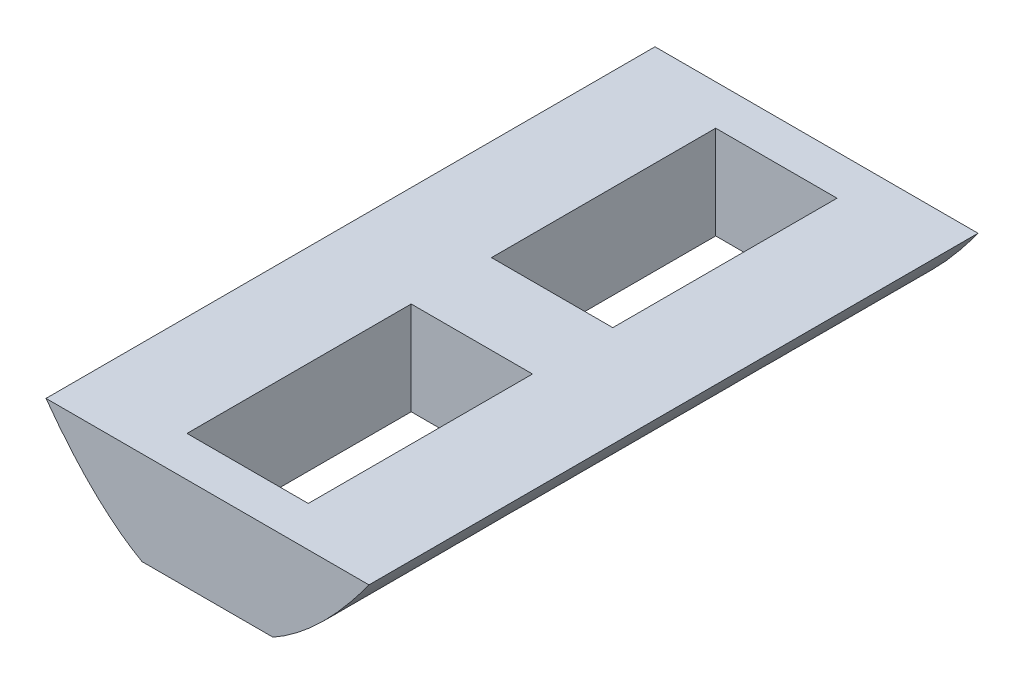
ISO-10303-21;
HEADER;
FILE_DESCRIPTION(('STEP AP214'),'2;1');
FILE_NAME('part.step','',(''),(''),'','','');
FILE_SCHEMA(('AUTOMOTIVE_DESIGN { 1 0 10303 214 1 1 1 1 }'));
ENDSEC;
DATA;
#1=APPLICATION_CONTEXT('core data for automotive mechanical design processes');
#2=APPLICATION_PROTOCOL_DEFINITION('international standard','automotive_design',2000,#1);
#3=PRODUCT_CONTEXT('',#1,'mechanical');
#4=PRODUCT('Part','Part','',(#3));
#5=PRODUCT_RELATED_PRODUCT_CATEGORY('part','',(#4));
#6=PRODUCT_DEFINITION_FORMATION('','',#4);
#7=PRODUCT_DEFINITION_CONTEXT('part definition',#1,'design');
#8=PRODUCT_DEFINITION('design','',#6,#7);
#9=PRODUCT_DEFINITION_SHAPE('','',#8);
#10=(LENGTH_UNIT() NAMED_UNIT(*) SI_UNIT(.MILLI.,.METRE.));
#11=(NAMED_UNIT(*) PLANE_ANGLE_UNIT() SI_UNIT($,.RADIAN.));
#12=(NAMED_UNIT(*) SI_UNIT($,.STERADIAN.) SOLID_ANGLE_UNIT());
#13=UNCERTAINTY_MEASURE_WITH_UNIT(LENGTH_MEASURE(1.E-05),#10,'distance_accuracy_value','');
#14=(GEOMETRIC_REPRESENTATION_CONTEXT(3) GLOBAL_UNCERTAINTY_ASSIGNED_CONTEXT((#13)) GLOBAL_UNIT_ASSIGNED_CONTEXT((#10,
#11,#12)) REPRESENTATION_CONTEXT('',''));
#15=CARTESIAN_POINT('',(0.,0.,0.));
#16=DIRECTION('',(0.,0.,1.));
#17=DIRECTION('',(1.,0.,0.));
#18=AXIS2_PLACEMENT_3D('',#15,#16,#17);
#19=CARTESIAN_POINT('',(-127.000000000214,127.000000000428,331.382));
#20=CARTESIAN_POINT('',(-3.79340656109228E-11,-127.000000000353,331.382));
#21=CARTESIAN_POINT('',(127.000000000138,127.000000000277,331.382));
#22=B_SPLINE_CURVE_WITH_KNOTS('',2,(#19,#20,#21),.UNSPECIFIED.,.F.,.F.,(3,3),
(0.0560283962320779,0.943971603767657),.UNSPECIFIED.);
#23=DIRECTION('',(0.,0.,-1.));
#24=VECTOR('',#23,1.);
#25=SURFACE_OF_LINEAR_EXTRUSION('',#22,#24);
#26=CARTESIAN_POINT('',(-87.8726351031225,60.8,331.382));
#27=VERTEX_POINT('',#26);
#28=CARTESIAN_POINT('',(-35.6370593624671,10.,331.382));
#29=VERTEX_POINT('',#28);
#30=EDGE_CURVE('E135',#27,#29,#22,.T.);
#31=ORIENTED_EDGE('',*,*,#30,.F.);
#32=DIRECTION('',(0.,0.,-1.));
#33=VECTOR('',#32,1.);
#34=CARTESIAN_POINT('',(-87.872635103313,60.8,331.382));
#35=LINE('',#34,#33);
#36=CARTESIAN_POINT('',(-87.8726351031226,60.8,0.));
#37=VERTEX_POINT('',#36);
#38=EDGE_CURVE('E121',#27,#37,#35,.T.);
#39=ORIENTED_EDGE('',*,*,#38,.T.);
#40=CARTESIAN_POINT('',(-127.000000000214,127.000000000428,0.));
#41=CARTESIAN_POINT('',(-3.79340656109228E-11,-127.000000000353,0.));
#42=CARTESIAN_POINT('',(127.000000000138,127.000000000277,0.));
#43=B_SPLINE_CURVE_WITH_KNOTS('',2,(#40,#41,#42),.UNSPECIFIED.,.F.,.F.,(3,3),
(0.0560283962320779,0.943971603767657),.UNSPECIFIED.);
#44=CARTESIAN_POINT('',(-35.6370593624671,10.0000000000315,0.));
#45=VERTEX_POINT('',#44);
#46=EDGE_CURVE('E144',#37,#45,#43,.T.);
#47=ORIENTED_EDGE('',*,*,#46,.T.);
#48=DIRECTION('',(0.,0.,-1.));
#49=VECTOR('',#48,1.);
#50=CARTESIAN_POINT('',(-35.6370593624108,9.99999999999995,331.382));
#51=LINE('',#50,#49);
#52=EDGE_CURVE('E142',#45,#29,#51,.F.);
#53=ORIENTED_EDGE('',*,*,#52,.T.);
#54=EDGE_LOOP('',(#31,#39,#47,#53));
#55=FACE_BOUND('',#54,.T.);
#56=ADVANCED_FACE('F33',(#55),#25,.F.);
#57=CARTESIAN_POINT('',(35.637059362467,10.,0.));
#58=VERTEX_POINT('',#57);
#59=CARTESIAN_POINT('',(87.8726351031226,60.7999999997364,0.));
#60=VERTEX_POINT('',#59);
#61=EDGE_CURVE('E157',#58,#60,#43,.T.);
#62=ORIENTED_EDGE('',*,*,#61,.T.);
#63=DIRECTION('',(0.,0.,-1.));
#64=VECTOR('',#63,1.);
#65=CARTESIAN_POINT('',(87.872635103313,60.8,331.382));
#66=LINE('',#65,#64);
#67=CARTESIAN_POINT('',(87.8726351031225,60.8,331.382));
#68=VERTEX_POINT('',#67);
#69=EDGE_CURVE('E49',#60,#68,#66,.F.);
#70=ORIENTED_EDGE('',*,*,#69,.T.);
#71=CARTESIAN_POINT('',(35.637059362467,10.,331.382));
#72=VERTEX_POINT('',#71);
#73=EDGE_CURVE('E138',#72,#68,#22,.T.);
#74=ORIENTED_EDGE('',*,*,#73,.F.);
#75=DIRECTION('',(0.,0.,-1.));
#76=VECTOR('',#75,1.);
#77=CARTESIAN_POINT('',(35.6370593624109,10.,331.382));
#78=LINE('',#77,#76);
#79=EDGE_CURVE('E208',#72,#58,#78,.T.);
#80=ORIENTED_EDGE('',*,*,#79,.T.);
#81=EDGE_LOOP('',(#62,#70,#74,#80));
#82=FACE_BOUND('',#81,.T.);
#83=ADVANCED_FACE('F35',(#82),#25,.F.);
#84=CARTESIAN_POINT('',(-3.79349329726608E-11,0.,331.382));
#85=DIRECTION('',(0.,0.,-1.));
#86=DIRECTION('',(-1.,0.,0.));
#87=AXIS2_PLACEMENT_3D('',#84,#85,#86);
#88=PLANE('',#87);
#89=ORIENTED_EDGE('',*,*,#73,.T.);
#90=DIRECTION('',(1.,0.,0.));
#91=VECTOR('',#90,1.);
#92=CARTESIAN_POINT('',(-130.,60.8,331.382));
#93=LINE('',#92,#91);
#94=EDGE_CURVE('E124',#27,#68,#93,.T.);
#95=ORIENTED_EDGE('',*,*,#94,.F.);
#96=ORIENTED_EDGE('',*,*,#30,.T.);
#97=DIRECTION('',(1.,0.,0.));
#98=VECTOR('',#97,1.);
#99=CARTESIAN_POINT('',(40.,10.,331.382));
#100=LINE('',#99,#98);
#101=EDGE_CURVE('E226',#29,#72,#100,.T.);
#102=ORIENTED_EDGE('',*,*,#101,.T.);
#103=EDGE_LOOP('',(#89,#95,#96,#102));
#104=FACE_BOUND('',#103,.T.);
#105=ADVANCED_FACE('F133',(#104),#88,.F.);
#106=CARTESIAN_POINT('',(-3.79349329726608E-11,0.,0.));
#107=DIRECTION('',(0.,0.,-1.));
#108=DIRECTION('',(-1.,0.,0.));
#109=AXIS2_PLACEMENT_3D('',#106,#107,#108);
#110=PLANE('',#109);
#111=DIRECTION('',(1.,0.,0.));
#112=VECTOR('',#111,1.);
#113=CARTESIAN_POINT('',(-130.,60.8,0.));
#114=LINE('',#113,#112);
#115=EDGE_CURVE('E125',#37,#60,#114,.T.);
#116=ORIENTED_EDGE('',*,*,#115,.T.);
#117=ORIENTED_EDGE('',*,*,#61,.F.);
#118=DIRECTION('',(1.,0.,0.));
#119=VECTOR('',#118,1.);
#120=CARTESIAN_POINT('',(40.,10.,0.));
#121=LINE('',#120,#119);
#122=EDGE_CURVE('E129',#45,#58,#121,.T.);
#123=ORIENTED_EDGE('',*,*,#122,.F.);
#124=ORIENTED_EDGE('',*,*,#46,.F.);
#125=EDGE_LOOP('',(#116,#117,#123,#124));
#126=FACE_BOUND('',#125,.T.);
#127=ADVANCED_FACE('F246',(#126),#110,.T.);
#128=CARTESIAN_POINT('',(-33.,-3.79141162909491E-11,21.8455));
#129=DIRECTION('',(-1.,0.,0.));
#130=DIRECTION('',(0.,0.,1.));
#131=AXIS2_PLACEMENT_3D('',#128,#129,#130);
#132=PLANE('',#131);
#133=DIRECTION('',(0.,1.,0.));
#134=VECTOR('',#133,1.);
#135=CARTESIAN_POINT('',(-33.,-3.79141162909491E-11,21.8455));
#136=LINE('',#135,#134);
#137=CARTESIAN_POINT('',(-33.,10.,21.8455));
#138=VERTEX_POINT('',#137);
#139=CARTESIAN_POINT('',(-33.,60.8,21.8455));
#140=VERTEX_POINT('',#139);
#141=EDGE_CURVE('E162',#138,#140,#136,.T.);
#142=ORIENTED_EDGE('',*,*,#141,.T.);
#143=DIRECTION('',(0.,0.,1.));
#144=VECTOR('',#143,1.);
#145=CARTESIAN_POINT('',(-33.,60.8,21.8455));
#146=LINE('',#145,#144);
#147=CARTESIAN_POINT('',(-33.,60.8,143.8455));
#148=VERTEX_POINT('',#147);
#149=EDGE_CURVE('E230',#140,#148,#146,.T.);
#150=ORIENTED_EDGE('',*,*,#149,.T.);
#151=DIRECTION('',(0.,1.,0.));
#152=VECTOR('',#151,1.);
#153=CARTESIAN_POINT('',(-33.,-3.79141162909491E-11,143.8455));
#154=LINE('',#153,#152);
#155=CARTESIAN_POINT('',(-33.,10.,143.8455));
#156=VERTEX_POINT('',#155);
#157=EDGE_CURVE('E150',#156,#148,#154,.T.);
#158=ORIENTED_EDGE('',*,*,#157,.F.);
#159=DIRECTION('',(0.,0.,-1.));
#160=VECTOR('',#159,1.);
#161=CARTESIAN_POINT('',(-33.,10.,21.8455));
#162=LINE('',#161,#160);
#163=EDGE_CURVE('E209',#156,#138,#162,.T.);
#164=ORIENTED_EDGE('',*,*,#163,.T.);
#165=EDGE_LOOP('',(#142,#150,#158,#164));
#166=FACE_BOUND('',#165,.T.);
#167=ADVANCED_FACE('F282',(#166),#132,.F.);
#168=CARTESIAN_POINT('',(-33.,-3.79141162909491E-11,21.8455));
#169=DIRECTION('',(0.,0.,-1.));
#170=DIRECTION('',(-1.,0.,0.));
#171=AXIS2_PLACEMENT_3D('',#168,#169,#170);
#172=PLANE('',#171);
#173=DIRECTION('',(0.,1.,0.));
#174=VECTOR('',#173,1.);
#175=CARTESIAN_POINT('',(33.,-3.79141162909491E-11,21.8455));
#176=LINE('',#175,#174);
#177=CARTESIAN_POINT('',(33.,10.,21.8455));
#178=VERTEX_POINT('',#177);
#179=CARTESIAN_POINT('',(33.,60.8,21.8455));
#180=VERTEX_POINT('',#179);
#181=EDGE_CURVE('E167',#178,#180,#176,.T.);
#182=ORIENTED_EDGE('',*,*,#181,.T.);
#183=DIRECTION('',(-1.,0.,0.));
#184=VECTOR('',#183,1.);
#185=CARTESIAN_POINT('',(-33.,60.8,21.8455));
#186=LINE('',#185,#184);
#187=EDGE_CURVE('E232',#180,#140,#186,.T.);
#188=ORIENTED_EDGE('',*,*,#187,.T.);
#189=ORIENTED_EDGE('',*,*,#141,.F.);
#190=DIRECTION('',(1.,0.,0.));
#191=VECTOR('',#190,1.);
#192=CARTESIAN_POINT('',(-33.,10.,21.8455));
#193=LINE('',#192,#191);
#194=EDGE_CURVE('E210',#138,#178,#193,.T.);
#195=ORIENTED_EDGE('',*,*,#194,.T.);
#196=EDGE_LOOP('',(#182,#188,#189,#195));
#197=FACE_BOUND('',#196,.T.);
#198=ADVANCED_FACE('F290',(#197),#172,.F.);
#199=CARTESIAN_POINT('',(33.,-3.79141162909491E-11,21.8455));
#200=DIRECTION('',(1.,0.,0.));
#201=DIRECTION('',(0.,0.,-1.));
#202=AXIS2_PLACEMENT_3D('',#199,#200,#201);
#203=PLANE('',#202);
#204=DIRECTION('',(0.,1.,0.));
#205=VECTOR('',#204,1.);
#206=CARTESIAN_POINT('',(33.,-3.79141162909491E-11,143.8455));
#207=LINE('',#206,#205);
#208=CARTESIAN_POINT('',(33.,10.,143.8455));
#209=VERTEX_POINT('',#208);
#210=CARTESIAN_POINT('',(33.,60.8,143.8455));
#211=VERTEX_POINT('',#210);
#212=EDGE_CURVE('E174',#209,#211,#207,.T.);
#213=ORIENTED_EDGE('',*,*,#212,.T.);
#214=DIRECTION('',(0.,0.,-1.));
#215=VECTOR('',#214,1.);
#216=CARTESIAN_POINT('',(33.,60.8,21.8455));
#217=LINE('',#216,#215);
#218=EDGE_CURVE('E57',#211,#180,#217,.T.);
#219=ORIENTED_EDGE('',*,*,#218,.T.);
#220=ORIENTED_EDGE('',*,*,#181,.F.);
#221=DIRECTION('',(0.,0.,1.));
#222=VECTOR('',#221,1.);
#223=CARTESIAN_POINT('',(33.,10.,21.8455));
#224=LINE('',#223,#222);
#225=EDGE_CURVE('E215',#178,#209,#224,.T.);
#226=ORIENTED_EDGE('',*,*,#225,.T.);
#227=EDGE_LOOP('',(#213,#219,#220,#226));
#228=FACE_BOUND('',#227,.T.);
#229=ADVANCED_FACE('F299',(#228),#203,.F.);
#230=CARTESIAN_POINT('',(-33.,-3.79141162909491E-11,143.8455));
#231=DIRECTION('',(0.,0.,1.));
#232=DIRECTION('',(1.,0.,0.));
#233=AXIS2_PLACEMENT_3D('',#230,#231,#232);
#234=PLANE('',#233);
#235=ORIENTED_EDGE('',*,*,#157,.T.);
#236=DIRECTION('',(1.,0.,0.));
#237=VECTOR('',#236,1.);
#238=CARTESIAN_POINT('',(-33.,60.8,143.8455));
#239=LINE('',#238,#237);
#240=EDGE_CURVE('E236',#148,#211,#239,.T.);
#241=ORIENTED_EDGE('',*,*,#240,.T.);
#242=ORIENTED_EDGE('',*,*,#212,.F.);
#243=DIRECTION('',(-1.,0.,0.));
#244=VECTOR('',#243,1.);
#245=CARTESIAN_POINT('',(-33.,10.,143.8455));
#246=LINE('',#245,#244);
#247=EDGE_CURVE('E217',#209,#156,#246,.T.);
#248=ORIENTED_EDGE('',*,*,#247,.T.);
#249=EDGE_LOOP('',(#235,#241,#242,#248));
#250=FACE_BOUND('',#249,.T.);
#251=ADVANCED_FACE('F309',(#250),#234,.F.);
#252=CARTESIAN_POINT('',(-33.,-3.79141162909491E-11,187.5365));
#253=DIRECTION('',(-1.,0.,0.));
#254=DIRECTION('',(0.,0.,1.));
#255=AXIS2_PLACEMENT_3D('',#252,#253,#254);
#256=PLANE('',#255);
#257=DIRECTION('',(0.,1.,0.));
#258=VECTOR('',#257,1.);
#259=CARTESIAN_POINT('',(-33.,-3.79141162909491E-11,187.5365));
#260=LINE('',#259,#258);
#261=CARTESIAN_POINT('',(-33.,10.,187.5365));
#262=VERTEX_POINT('',#261);
#263=CARTESIAN_POINT('',(-33.,60.8,187.5365));
#264=VERTEX_POINT('',#263);
#265=EDGE_CURVE('E184',#262,#264,#260,.T.);
#266=ORIENTED_EDGE('',*,*,#265,.T.);
#267=DIRECTION('',(0.,0.,1.));
#268=VECTOR('',#267,1.);
#269=CARTESIAN_POINT('',(-33.,60.8,187.5365));
#270=LINE('',#269,#268);
#271=CARTESIAN_POINT('',(-33.,60.8,309.5365));
#272=VERTEX_POINT('',#271);
#273=EDGE_CURVE('E238',#264,#272,#270,.T.);
#274=ORIENTED_EDGE('',*,*,#273,.T.);
#275=DIRECTION('',(0.,1.,0.));
#276=VECTOR('',#275,1.);
#277=CARTESIAN_POINT('',(-33.,-3.79141162909491E-11,309.5365));
#278=LINE('',#277,#276);
#279=CARTESIAN_POINT('',(-33.,10.,309.5365));
#280=VERTEX_POINT('',#279);
#281=EDGE_CURVE('E177',#280,#272,#278,.T.);
#282=ORIENTED_EDGE('',*,*,#281,.F.);
#283=DIRECTION('',(0.,0.,-1.));
#284=VECTOR('',#283,1.);
#285=CARTESIAN_POINT('',(-33.,10.,187.5365));
#286=LINE('',#285,#284);
#287=EDGE_CURVE('E219',#280,#262,#286,.T.);
#288=ORIENTED_EDGE('',*,*,#287,.T.);
#289=EDGE_LOOP('',(#266,#274,#282,#288));
#290=FACE_BOUND('',#289,.T.);
#291=ADVANCED_FACE('F318',(#290),#256,.F.);
#292=CARTESIAN_POINT('',(-33.,-3.79141162909491E-11,187.5365));
#293=DIRECTION('',(0.,0.,-1.));
#294=DIRECTION('',(-1.,0.,0.));
#295=AXIS2_PLACEMENT_3D('',#292,#293,#294);
#296=PLANE('',#295);
#297=DIRECTION('',(0.,1.,0.));
#298=VECTOR('',#297,1.);
#299=CARTESIAN_POINT('',(33.,-3.79141162909491E-11,187.5365));
#300=LINE('',#299,#298);
#301=CARTESIAN_POINT('',(33.,10.,187.5365));
#302=VERTEX_POINT('',#301);
#303=CARTESIAN_POINT('',(33.,60.8,187.5365));
#304=VERTEX_POINT('',#303);
#305=EDGE_CURVE('E189',#302,#304,#300,.T.);
#306=ORIENTED_EDGE('',*,*,#305,.T.);
#307=DIRECTION('',(-1.,0.,0.));
#308=VECTOR('',#307,1.);
#309=CARTESIAN_POINT('',(-33.,60.8,187.5365));
#310=LINE('',#309,#308);
#311=EDGE_CURVE('E240',#304,#264,#310,.T.);
#312=ORIENTED_EDGE('',*,*,#311,.T.);
#313=ORIENTED_EDGE('',*,*,#265,.F.);
#314=DIRECTION('',(1.,0.,0.));
#315=VECTOR('',#314,1.);
#316=CARTESIAN_POINT('',(-33.,10.,187.5365));
#317=LINE('',#316,#315);
#318=EDGE_CURVE('E221',#262,#302,#317,.T.);
#319=ORIENTED_EDGE('',*,*,#318,.T.);
#320=EDGE_LOOP('',(#306,#312,#313,#319));
#321=FACE_BOUND('',#320,.T.);
#322=ADVANCED_FACE('F327',(#321),#296,.F.);
#323=CARTESIAN_POINT('',(33.,-3.79141162909491E-11,187.5365));
#324=DIRECTION('',(1.,0.,0.));
#325=DIRECTION('',(0.,0.,-1.));
#326=AXIS2_PLACEMENT_3D('',#323,#324,#325);
#327=PLANE('',#326);
#328=DIRECTION('',(0.,1.,0.));
#329=VECTOR('',#328,1.);
#330=CARTESIAN_POINT('',(33.,-3.79141162909491E-11,309.5365));
#331=LINE('',#330,#329);
#332=CARTESIAN_POINT('',(33.,10.,309.5365));
#333=VERTEX_POINT('',#332);
#334=CARTESIAN_POINT('',(33.,60.8,309.5365));
#335=VERTEX_POINT('',#334);
#336=EDGE_CURVE('E196',#333,#335,#331,.T.);
#337=ORIENTED_EDGE('',*,*,#336,.T.);
#338=DIRECTION('',(0.,0.,-1.));
#339=VECTOR('',#338,1.);
#340=CARTESIAN_POINT('',(33.,60.8,187.5365));
#341=LINE('',#340,#339);
#342=EDGE_CURVE('E243',#335,#304,#341,.T.);
#343=ORIENTED_EDGE('',*,*,#342,.T.);
#344=ORIENTED_EDGE('',*,*,#305,.F.);
#345=DIRECTION('',(0.,0.,1.));
#346=VECTOR('',#345,1.);
#347=CARTESIAN_POINT('',(33.,10.,187.5365));
#348=LINE('',#347,#346);
#349=EDGE_CURVE('E224',#302,#333,#348,.T.);
#350=ORIENTED_EDGE('',*,*,#349,.T.);
#351=EDGE_LOOP('',(#337,#343,#344,#350));
#352=FACE_BOUND('',#351,.T.);
#353=ADVANCED_FACE('F336',(#352),#327,.F.);
#354=CARTESIAN_POINT('',(-33.,-3.79141162909491E-11,309.5365));
#355=DIRECTION('',(0.,0.,1.));
#356=DIRECTION('',(1.,0.,0.));
#357=AXIS2_PLACEMENT_3D('',#354,#355,#356);
#358=PLANE('',#357);
#359=ORIENTED_EDGE('',*,*,#281,.T.);
#360=DIRECTION('',(1.,0.,0.));
#361=VECTOR('',#360,1.);
#362=CARTESIAN_POINT('',(-33.,60.8,309.5365));
#363=LINE('',#362,#361);
#364=EDGE_CURVE('E11',#272,#335,#363,.T.);
#365=ORIENTED_EDGE('',*,*,#364,.T.);
#366=ORIENTED_EDGE('',*,*,#336,.F.);
#367=DIRECTION('',(-1.,0.,0.));
#368=VECTOR('',#367,1.);
#369=CARTESIAN_POINT('',(-33.,10.,309.5365));
#370=LINE('',#369,#368);
#371=EDGE_CURVE('E42',#333,#280,#370,.T.);
#372=ORIENTED_EDGE('',*,*,#371,.T.);
#373=EDGE_LOOP('',(#359,#365,#366,#372));
#374=FACE_BOUND('',#373,.T.);
#375=ADVANCED_FACE('F346',(#374),#358,.F.);
#376=CARTESIAN_POINT('',(40.,10.,331.382));
#377=DIRECTION('',(0.,1.,0.));
#378=DIRECTION('',(0.,0.,1.));
#379=AXIS2_PLACEMENT_3D('',#376,#377,#378);
#380=PLANE('',#379);
#381=ORIENTED_EDGE('',*,*,#371,.F.);
#382=ORIENTED_EDGE('',*,*,#349,.F.);
#383=ORIENTED_EDGE('',*,*,#318,.F.);
#384=ORIENTED_EDGE('',*,*,#287,.F.);
#385=EDGE_LOOP('',(#381,#382,#383,#384));
#386=FACE_BOUND('',#385,.T.);
#387=ORIENTED_EDGE('',*,*,#247,.F.);
#388=ORIENTED_EDGE('',*,*,#225,.F.);
#389=ORIENTED_EDGE('',*,*,#194,.F.);
#390=ORIENTED_EDGE('',*,*,#163,.F.);
#391=EDGE_LOOP('',(#387,#388,#389,#390));
#392=FACE_BOUND('',#391,.T.);
#393=ORIENTED_EDGE('',*,*,#122,.T.);
#394=ORIENTED_EDGE('',*,*,#79,.F.);
#395=ORIENTED_EDGE('',*,*,#101,.F.);
#396=ORIENTED_EDGE('',*,*,#52,.F.);
#397=EDGE_LOOP('',(#393,#394,#395,#396));
#398=FACE_BOUND('',#397,.T.);
#399=ADVANCED_FACE('F249',(#386,#392,#398),#380,.F.);
#400=CARTESIAN_POINT('',(-130.,60.8,0.));
#401=DIRECTION('',(0.,-1.,0.));
#402=DIRECTION('',(0.,0.,-1.));
#403=AXIS2_PLACEMENT_3D('',#400,#401,#402);
#404=PLANE('',#403);
#405=ORIENTED_EDGE('',*,*,#311,.F.);
#406=ORIENTED_EDGE('',*,*,#342,.F.);
#407=ORIENTED_EDGE('',*,*,#364,.F.);
#408=ORIENTED_EDGE('',*,*,#273,.F.);
#409=EDGE_LOOP('',(#405,#406,#407,#408));
#410=FACE_BOUND('',#409,.T.);
#411=ORIENTED_EDGE('',*,*,#187,.F.);
#412=ORIENTED_EDGE('',*,*,#218,.F.);
#413=ORIENTED_EDGE('',*,*,#240,.F.);
#414=ORIENTED_EDGE('',*,*,#149,.F.);
#415=EDGE_LOOP('',(#411,#412,#413,#414));
#416=FACE_BOUND('',#415,.T.);
#417=ORIENTED_EDGE('',*,*,#94,.T.);
#418=ORIENTED_EDGE('',*,*,#69,.F.);
#419=ORIENTED_EDGE('',*,*,#115,.F.);
#420=ORIENTED_EDGE('',*,*,#38,.F.);
#421=EDGE_LOOP('',(#417,#418,#419,#420));
#422=FACE_BOUND('',#421,.T.);
#423=ADVANCED_FACE('F123',(#410,#416,#422),#404,.F.);
#424=CLOSED_SHELL('',(#56,#83,#105,#127,#167,#198,#229,#251,#291,#322,#353,#375,#399,#423));
#425=MANIFOLD_SOLID_BREP('B2',#424);
#426=ADVANCED_BREP_SHAPE_REPRESENTATION('',(#18,#425),#14);
#427=SHAPE_DEFINITION_REPRESENTATION(#9,#426);
ENDSEC;
END-ISO-10303-21;
